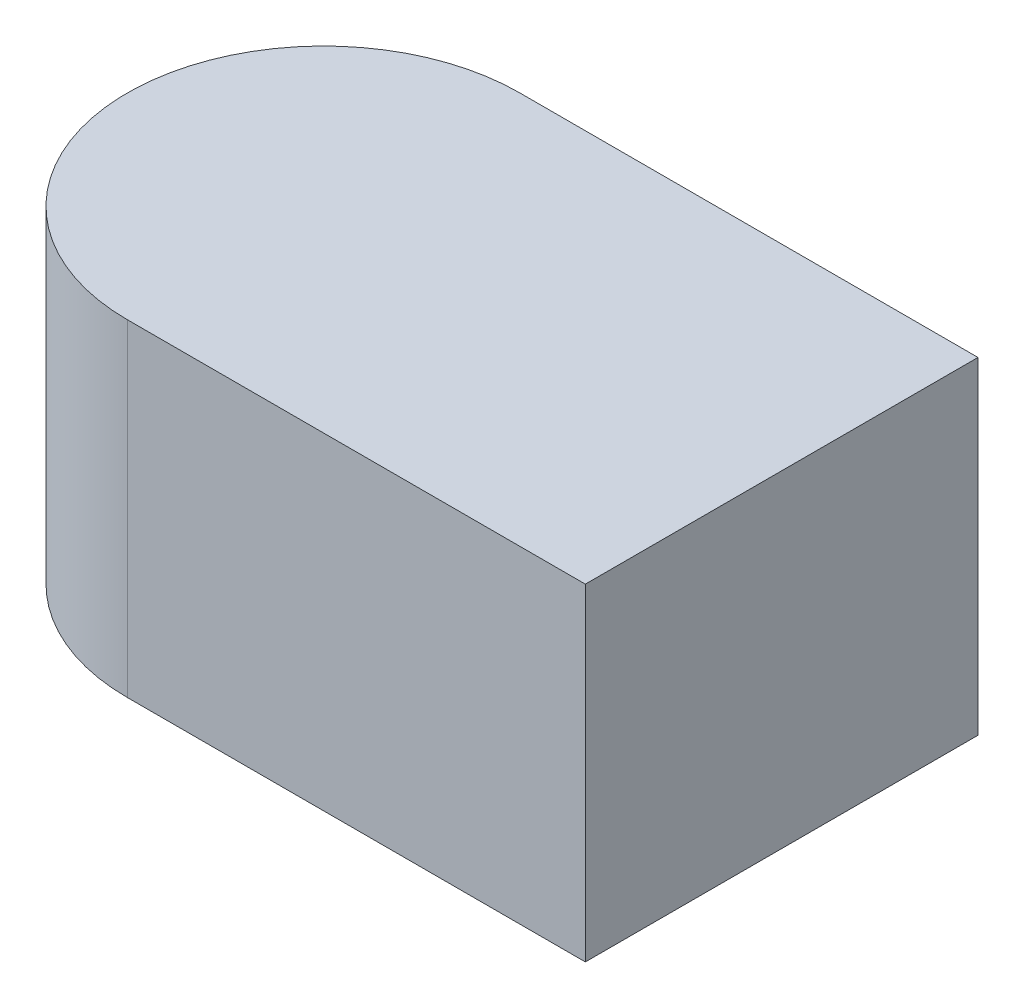
ISO-10303-21;
HEADER;
FILE_DESCRIPTION(('STEP AP214'),'2;1');
FILE_NAME('part.step','',(''),(''),'','','');
FILE_SCHEMA(('AUTOMOTIVE_DESIGN { 1 0 10303 214 1 1 1 1 }'));
ENDSEC;
DATA;
#1=APPLICATION_CONTEXT('core data for automotive mechanical design processes');
#2=APPLICATION_PROTOCOL_DEFINITION('international standard','automotive_design',2000,#1);
#3=PRODUCT_CONTEXT('',#1,'mechanical');
#4=PRODUCT('Part','Part','',(#3));
#5=PRODUCT_RELATED_PRODUCT_CATEGORY('part','',(#4));
#6=PRODUCT_DEFINITION_FORMATION('','',#4);
#7=PRODUCT_DEFINITION_CONTEXT('part definition',#1,'design');
#8=PRODUCT_DEFINITION('design','',#6,#7);
#9=PRODUCT_DEFINITION_SHAPE('','',#8);
#10=(LENGTH_UNIT() NAMED_UNIT(*) SI_UNIT(.MILLI.,.METRE.));
#11=(NAMED_UNIT(*) PLANE_ANGLE_UNIT() SI_UNIT($,.RADIAN.));
#12=(NAMED_UNIT(*) SI_UNIT($,.STERADIAN.) SOLID_ANGLE_UNIT());
#13=UNCERTAINTY_MEASURE_WITH_UNIT(LENGTH_MEASURE(1.E-05),#10,'distance_accuracy_value','');
#14=(GEOMETRIC_REPRESENTATION_CONTEXT(3) GLOBAL_UNCERTAINTY_ASSIGNED_CONTEXT((#13)) GLOBAL_UNIT_ASSIGNED_CONTEXT((#10,
#11,#12)) REPRESENTATION_CONTEXT('',''));
#15=CARTESIAN_POINT('',(0.,0.,0.));
#16=DIRECTION('',(0.,0.,1.));
#17=DIRECTION('',(1.,0.,0.));
#18=AXIS2_PLACEMENT_3D('',#15,#16,#17);
#19=CARTESIAN_POINT('',(0.,0.,0.));
#20=DIRECTION('',(0.,1.,0.));
#21=DIRECTION('',(1.,0.,0.));
#22=AXIS2_PLACEMENT_3D('',#19,#20,#21);
#23=PLANE('',#22);
#24=DIRECTION('',(0.,0.,-1.));
#25=VECTOR('',#24,1.);
#26=CARTESIAN_POINT('',(1.75,0.,-0.13));
#27=LINE('',#26,#25);
#28=CARTESIAN_POINT('',(1.75,0.,-0.13));
#29=VERTEX_POINT('',#28);
#30=CARTESIAN_POINT('',(1.75,0.,-0.37));
#31=VERTEX_POINT('',#30);
#32=EDGE_CURVE('E11',#29,#31,#27,.T.);
#33=ORIENTED_EDGE('',*,*,#32,.F.);
#34=DIRECTION('',(1.,0.,0.));
#35=VECTOR('',#34,1.);
#36=CARTESIAN_POINT('',(1.47,0.,-0.13));
#37=LINE('',#36,#35);
#38=CARTESIAN_POINT('',(1.47,0.,-0.13));
#39=VERTEX_POINT('',#38);
#40=EDGE_CURVE('E24',#39,#29,#37,.T.);
#41=ORIENTED_EDGE('',*,*,#40,.F.);
#42=CARTESIAN_POINT('',(1.47,0.,-0.25));
#43=DIRECTION('',(0.,1.,0.));
#44=DIRECTION('',(0.,0.,-1.));
#45=AXIS2_PLACEMENT_3D('',#42,#43,#44);
#46=CIRCLE('',#45,0.12);
#47=CARTESIAN_POINT('',(1.47,0.,-0.37));
#48=VERTEX_POINT('',#47);
#49=EDGE_CURVE('E61',#48,#39,#46,.T.);
#50=ORIENTED_EDGE('',*,*,#49,.F.);
#51=DIRECTION('',(-1.,0.,0.));
#52=VECTOR('',#51,1.);
#53=CARTESIAN_POINT('',(1.75,0.,-0.37));
#54=LINE('',#53,#52);
#55=EDGE_CURVE('E37',#31,#48,#54,.T.);
#56=ORIENTED_EDGE('',*,*,#55,.F.);
#57=EDGE_LOOP('',(#33,#41,#50,#56));
#58=FACE_BOUND('',#57,.T.);
#59=ADVANCED_FACE('F17',(#58),#23,.F.);
#60=CARTESIAN_POINT('',(1.75,0.,-0.37));
#61=DIRECTION('',(0.,0.,-1.));
#62=DIRECTION('',(-1.,0.,0.));
#63=AXIS2_PLACEMENT_3D('',#60,#61,#62);
#64=PLANE('',#63);
#65=DIRECTION('',(0.,1.,0.));
#66=VECTOR('',#65,1.);
#67=CARTESIAN_POINT('',(1.47,0.,-0.37));
#68=LINE('',#67,#66);
#69=CARTESIAN_POINT('',(1.47,0.2,-0.37));
#70=VERTEX_POINT('',#69);
#71=EDGE_CURVE('E84',#48,#70,#68,.T.);
#72=ORIENTED_EDGE('',*,*,#71,.T.);
#73=DIRECTION('',(-1.,0.,0.));
#74=VECTOR('',#73,1.);
#75=CARTESIAN_POINT('',(1.75,0.2,-0.37));
#76=LINE('',#75,#74);
#77=CARTESIAN_POINT('',(1.75,0.2,-0.37));
#78=VERTEX_POINT('',#77);
#79=EDGE_CURVE('E74',#78,#70,#76,.T.);
#80=ORIENTED_EDGE('',*,*,#79,.F.);
#81=DIRECTION('',(0.,1.,0.));
#82=VECTOR('',#81,1.);
#83=CARTESIAN_POINT('',(1.75,0.,-0.37));
#84=LINE('',#83,#82);
#85=EDGE_CURVE('E81',#31,#78,#84,.T.);
#86=ORIENTED_EDGE('',*,*,#85,.F.);
#87=ORIENTED_EDGE('',*,*,#55,.T.);
#88=EDGE_LOOP('',(#72,#80,#86,#87));
#89=FACE_BOUND('',#88,.T.);
#90=ADVANCED_FACE('F89',(#89),#64,.T.);
#91=CARTESIAN_POINT('',(1.75,0.,-0.13));
#92=DIRECTION('',(1.,0.,0.));
#93=DIRECTION('',(0.,0.,-1.));
#94=AXIS2_PLACEMENT_3D('',#91,#92,#93);
#95=PLANE('',#94);
#96=ORIENTED_EDGE('',*,*,#85,.T.);
#97=DIRECTION('',(0.,0.,-1.));
#98=VECTOR('',#97,1.);
#99=CARTESIAN_POINT('',(1.75,0.2,-0.13));
#100=LINE('',#99,#98);
#101=CARTESIAN_POINT('',(1.75,0.2,-0.13));
#102=VERTEX_POINT('',#101);
#103=EDGE_CURVE('E79',#102,#78,#100,.T.);
#104=ORIENTED_EDGE('',*,*,#103,.F.);
#105=DIRECTION('',(0.,1.,0.));
#106=VECTOR('',#105,1.);
#107=CARTESIAN_POINT('',(1.75,0.,-0.13));
#108=LINE('',#107,#106);
#109=EDGE_CURVE('E67',#29,#102,#108,.T.);
#110=ORIENTED_EDGE('',*,*,#109,.F.);
#111=ORIENTED_EDGE('',*,*,#32,.T.);
#112=EDGE_LOOP('',(#96,#104,#110,#111));
#113=FACE_BOUND('',#112,.T.);
#114=ADVANCED_FACE('F91',(#113),#95,.T.);
#115=CARTESIAN_POINT('',(1.47,0.,-0.13));
#116=DIRECTION('',(0.,0.,1.));
#117=DIRECTION('',(1.,0.,0.));
#118=AXIS2_PLACEMENT_3D('',#115,#116,#117);
#119=PLANE('',#118);
#120=ORIENTED_EDGE('',*,*,#109,.T.);
#121=DIRECTION('',(1.,0.,0.));
#122=VECTOR('',#121,1.);
#123=CARTESIAN_POINT('',(1.47,0.2,-0.13));
#124=LINE('',#123,#122);
#125=CARTESIAN_POINT('',(1.47,0.2,-0.13));
#126=VERTEX_POINT('',#125);
#127=EDGE_CURVE('E62',#126,#102,#124,.T.);
#128=ORIENTED_EDGE('',*,*,#127,.F.);
#129=DIRECTION('',(0.,1.,0.));
#130=VECTOR('',#129,1.);
#131=CARTESIAN_POINT('',(1.47,0.,-0.13));
#132=LINE('',#131,#130);
#133=EDGE_CURVE('E55',#39,#126,#132,.T.);
#134=ORIENTED_EDGE('',*,*,#133,.F.);
#135=ORIENTED_EDGE('',*,*,#40,.T.);
#136=EDGE_LOOP('',(#120,#128,#134,#135));
#137=FACE_BOUND('',#136,.T.);
#138=ADVANCED_FACE('F65',(#137),#119,.T.);
#139=CARTESIAN_POINT('',(1.47,0.,-0.25));
#140=DIRECTION('',(0.,1.,0.));
#141=DIRECTION('',(1.,0.,0.));
#142=AXIS2_PLACEMENT_3D('',#139,#140,#141);
#143=CYLINDRICAL_SURFACE('',#142,0.12);
#144=ORIENTED_EDGE('',*,*,#133,.T.);
#145=CARTESIAN_POINT('',(1.47,0.2,-0.25));
#146=DIRECTION('',(0.,1.,0.));
#147=DIRECTION('',(0.,0.,-1.));
#148=AXIS2_PLACEMENT_3D('',#145,#146,#147);
#149=CIRCLE('',#148,0.12);
#150=EDGE_CURVE('E60',#70,#126,#149,.T.);
#151=ORIENTED_EDGE('',*,*,#150,.F.);
#152=ORIENTED_EDGE('',*,*,#71,.F.);
#153=ORIENTED_EDGE('',*,*,#49,.T.);
#154=EDGE_LOOP('',(#144,#151,#152,#153));
#155=FACE_BOUND('',#154,.T.);
#156=ADVANCED_FACE('F57',(#155),#143,.T.);
#157=CARTESIAN_POINT('',(0.,0.2,0.));
#158=DIRECTION('',(0.,1.,0.));
#159=DIRECTION('',(1.,0.,0.));
#160=AXIS2_PLACEMENT_3D('',#157,#158,#159);
#161=PLANE('',#160);
#162=ORIENTED_EDGE('',*,*,#150,.T.);
#163=ORIENTED_EDGE('',*,*,#127,.T.);
#164=ORIENTED_EDGE('',*,*,#103,.T.);
#165=ORIENTED_EDGE('',*,*,#79,.T.);
#166=EDGE_LOOP('',(#162,#163,#164,#165));
#167=FACE_BOUND('',#166,.T.);
#168=ADVANCED_FACE('F72',(#167),#161,.T.);
#169=CLOSED_SHELL('',(#59,#90,#114,#138,#156,#168));
#170=MANIFOLD_SOLID_BREP('B1',#169);
#171=ADVANCED_BREP_SHAPE_REPRESENTATION('',(#18,#170),#14);
#172=SHAPE_DEFINITION_REPRESENTATION(#9,#171);
ENDSEC;
END-ISO-10303-21;
